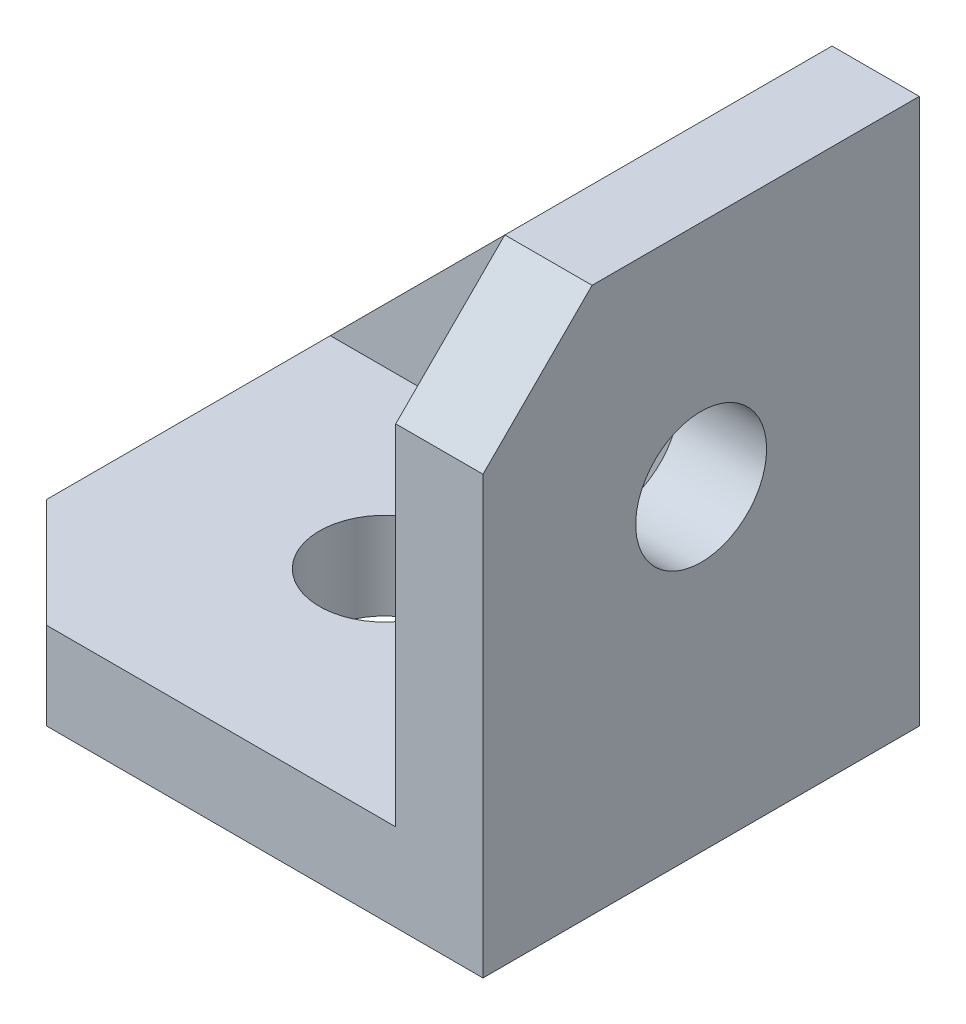
ISO-10303-21;
HEADER;
FILE_DESCRIPTION(('STEP AP214'),'2;1');
FILE_NAME('part.step','',(''),(''),'','','');
FILE_SCHEMA(('AUTOMOTIVE_DESIGN { 1 0 10303 214 1 1 1 1 }'));
ENDSEC;
DATA;
#1=APPLICATION_CONTEXT('core data for automotive mechanical design processes');
#2=APPLICATION_PROTOCOL_DEFINITION('international standard','automotive_design',2000,#1);
#3=PRODUCT_CONTEXT('',#1,'mechanical');
#4=PRODUCT('Part','Part','',(#3));
#5=PRODUCT_RELATED_PRODUCT_CATEGORY('part','',(#4));
#6=PRODUCT_DEFINITION_FORMATION('','',#4);
#7=PRODUCT_DEFINITION_CONTEXT('part definition',#1,'design');
#8=PRODUCT_DEFINITION('design','',#6,#7);
#9=PRODUCT_DEFINITION_SHAPE('','',#8);
#10=(LENGTH_UNIT() NAMED_UNIT(*) SI_UNIT(.MILLI.,.METRE.));
#11=(NAMED_UNIT(*) PLANE_ANGLE_UNIT() SI_UNIT($,.RADIAN.));
#12=(NAMED_UNIT(*) SI_UNIT($,.STERADIAN.) SOLID_ANGLE_UNIT());
#13=UNCERTAINTY_MEASURE_WITH_UNIT(LENGTH_MEASURE(1.E-05),#10,'distance_accuracy_value','');
#14=(GEOMETRIC_REPRESENTATION_CONTEXT(3) GLOBAL_UNCERTAINTY_ASSIGNED_CONTEXT((#13)) GLOBAL_UNIT_ASSIGNED_CONTEXT((#10,
#11,#12)) REPRESENTATION_CONTEXT('',''));
#15=CARTESIAN_POINT('',(0.,0.,0.));
#16=DIRECTION('',(0.,0.,1.));
#17=DIRECTION('',(1.,0.,0.));
#18=AXIS2_PLACEMENT_3D('',#15,#16,#17);
#19=CARTESIAN_POINT('',(-22.2500000000004,1010.,9.00023424550686));
#20=DIRECTION('',(0.,-1.,0.));
#21=DIRECTION('',(0.,0.,-1.));
#22=AXIS2_PLACEMENT_3D('',#19,#20,#21);
#23=PLANE('',#22);
#24=CARTESIAN_POINT('',(-32.75,1010.,-0.999765754493011));
#25=DIRECTION('',(0.,-1.,0.));
#26=DIRECTION('',(0.,0.,-1.));
#27=AXIS2_PLACEMENT_3D('',#24,#25,#26);
#28=CIRCLE('',#27,2.99999999999999);
#29=CARTESIAN_POINT('',(-32.75,1010.,-3.999765754493));
#30=VERTEX_POINT('',#29);
#31=EDGE_CURVE('E150',#30,#30,#28,.T.);
#32=ORIENTED_EDGE('',*,*,#31,.T.);
#33=EDGE_LOOP('',(#32));
#34=FACE_BOUND('',#33,.T.);
#35=DIRECTION('',(0.,0.,-1.));
#36=VECTOR('',#35,1.);
#37=CARTESIAN_POINT('',(-43.25,1010.,9.00023424550686));
#38=LINE('',#37,#36);
#39=CARTESIAN_POINT('',(-43.25,1010.,4.00023424550683));
#40=VERTEX_POINT('',#39);
#41=CARTESIAN_POINT('',(-43.25,1010.,-8.99976575449301));
#42=VERTEX_POINT('',#41);
#43=EDGE_CURVE('E157',#40,#42,#38,.T.);
#44=ORIENTED_EDGE('',*,*,#43,.F.);
#45=DIRECTION('',(0.707106781186543,0.,0.707106781186552));
#46=VECTOR('',#45,1.);
#47=CARTESIAN_POINT('',(-38.2499999999997,1010.,9.00023424550684));
#48=LINE('',#47,#46);
#49=CARTESIAN_POINT('',(-38.2499999999997,1010.,9.00023424550686));
#50=VERTEX_POINT('',#49);
#51=EDGE_CURVE('E43',#40,#50,#48,.T.);
#52=ORIENTED_EDGE('',*,*,#51,.T.);
#53=DIRECTION('',(-1.,0.,0.));
#54=VECTOR('',#53,1.);
#55=CARTESIAN_POINT('',(-22.2500000000004,1010.,9.00023424550686));
#56=LINE('',#55,#54);
#57=CARTESIAN_POINT('',(-22.2500000000004,1010.,9.00023424550686));
#58=VERTEX_POINT('',#57);
#59=EDGE_CURVE('E153',#58,#50,#56,.T.);
#60=ORIENTED_EDGE('',*,*,#59,.F.);
#61=DIRECTION('',(0.,0.,-1.));
#62=VECTOR('',#61,1.);
#63=CARTESIAN_POINT('',(-22.2500000000004,1010.,9.00023424550686));
#64=LINE('',#63,#62);
#65=CARTESIAN_POINT('',(-22.2500000000004,1010.,-8.99976575449314));
#66=VERTEX_POINT('',#65);
#67=EDGE_CURVE('E160',#58,#66,#64,.T.);
#68=ORIENTED_EDGE('',*,*,#67,.T.);
#69=DIRECTION('',(1.,0.,0.));
#70=VECTOR('',#69,1.);
#71=CARTESIAN_POINT('',(-22.2500000000006,1010.,-8.99976575449312));
#72=LINE('',#71,#70);
#73=EDGE_CURVE('E137',#42,#66,#72,.T.);
#74=ORIENTED_EDGE('',*,*,#73,.F.);
#75=EDGE_LOOP('',(#44,#52,#60,#68,#74));
#76=FACE_BOUND('',#75,.T.);
#77=ADVANCED_FACE('F35',(#34,#76),#23,.F.);
#78=CARTESIAN_POINT('',(-22.2500000000004,1031.,9.00023424550684));
#79=DIRECTION('',(1.,0.,0.));
#80=DIRECTION('',(0.,0.,-1.));
#81=AXIS2_PLACEMENT_3D('',#78,#79,#80);
#82=PLANE('',#81);
#83=CARTESIAN_POINT('',(-22.2500000000004,1020.5,-0.999765754493179));
#84=DIRECTION('',(1.,0.,0.));
#85=DIRECTION('',(0.,0.,-1.));
#86=AXIS2_PLACEMENT_3D('',#83,#84,#85);
#87=CIRCLE('',#86,2.99999999999989);
#88=CARTESIAN_POINT('',(-22.2500000000004,1020.5,-3.99976575449307));
#89=VERTEX_POINT('',#88);
#90=EDGE_CURVE('E146',#89,#89,#87,.T.);
#91=ORIENTED_EDGE('',*,*,#90,.T.);
#92=EDGE_LOOP('',(#91));
#93=FACE_BOUND('',#92,.T.);
#94=DIRECTION('',(0.,-1.,0.));
#95=VECTOR('',#94,1.);
#96=CARTESIAN_POINT('',(-22.2500000000004,1031.,9.00023424550684));
#97=LINE('',#96,#95);
#98=CARTESIAN_POINT('',(-22.2500000000004,1026.,9.00023424550684));
#99=VERTEX_POINT('',#98);
#100=EDGE_CURVE('E151',#99,#58,#97,.T.);
#101=ORIENTED_EDGE('',*,*,#100,.F.);
#102=DIRECTION('',(0.,-0.707106781186546,0.707106781186549));
#103=VECTOR('',#102,1.);
#104=CARTESIAN_POINT('',(-22.2500000000004,1031.,4.0002342455069));
#105=LINE('',#104,#103);
#106=CARTESIAN_POINT('',(-22.2500000000004,1031.,4.0002342455069));
#107=VERTEX_POINT('',#106);
#108=EDGE_CURVE('E192',#99,#107,#105,.F.);
#109=ORIENTED_EDGE('',*,*,#108,.T.);
#110=DIRECTION('',(0.,0.,-1.));
#111=VECTOR('',#110,1.);
#112=CARTESIAN_POINT('',(-22.2500000000004,1031.,9.00023424550684));
#113=LINE('',#112,#111);
#114=CARTESIAN_POINT('',(-22.2500000000004,1031.,-8.99976575449315));
#115=VERTEX_POINT('',#114);
#116=EDGE_CURVE('E163',#107,#115,#113,.T.);
#117=ORIENTED_EDGE('',*,*,#116,.T.);
#118=DIRECTION('',(0.,1.,0.));
#119=VECTOR('',#118,1.);
#120=CARTESIAN_POINT('',(-22.2500000000004,1031.,-8.99976575449315));
#121=LINE('',#120,#119);
#122=EDGE_CURVE('E174',#66,#115,#121,.T.);
#123=ORIENTED_EDGE('',*,*,#122,.F.);
#124=ORIENTED_EDGE('',*,*,#67,.F.);
#125=EDGE_LOOP('',(#101,#109,#117,#123,#124));
#126=FACE_BOUND('',#125,.T.);
#127=ADVANCED_FACE('F208',(#93,#126),#82,.F.);
#128=CARTESIAN_POINT('',(-43.2499999999996,1006.,9.00023424550684));
#129=DIRECTION('',(0.,-1.,0.));
#130=DIRECTION('',(0.,0.,-1.));
#131=AXIS2_PLACEMENT_3D('',#128,#129,#130);
#132=PLANE('',#131);
#133=DIRECTION('',(-1.,0.,0.));
#134=VECTOR('',#133,1.);
#135=CARTESIAN_POINT('',(-43.2499999999996,1006.,-10.9997657544931));
#136=LINE('',#135,#134);
#137=CARTESIAN_POINT('',(-18.25,1006.,-10.9997657544931));
#138=VERTEX_POINT('',#137);
#139=CARTESIAN_POINT('',(-43.2499999999996,1006.,-10.9997657544931));
#140=VERTEX_POINT('',#139);
#141=EDGE_CURVE('E131',#138,#140,#136,.T.);
#142=ORIENTED_EDGE('',*,*,#141,.F.);
#143=DIRECTION('',(0.,0.,-1.));
#144=VECTOR('',#143,1.);
#145=CARTESIAN_POINT('',(-18.25,1006.,9.00023424550684));
#146=LINE('',#145,#144);
#147=CARTESIAN_POINT('',(-18.25,1006.,9.00023424550684));
#148=VERTEX_POINT('',#147);
#149=EDGE_CURVE('E113',#148,#138,#146,.T.);
#150=ORIENTED_EDGE('',*,*,#149,.F.);
#151=DIRECTION('',(1.,0.,0.));
#152=VECTOR('',#151,1.);
#153=CARTESIAN_POINT('',(-43.2499999999996,1006.,9.00023424550684));
#154=LINE('',#153,#152);
#155=CARTESIAN_POINT('',(-38.2499999999997,1006.,9.00023424550684));
#156=VERTEX_POINT('',#155);
#157=EDGE_CURVE('E169',#156,#148,#154,.T.);
#158=ORIENTED_EDGE('',*,*,#157,.F.);
#159=DIRECTION('',(-0.707106781186543,0.,-0.707106781186552));
#160=VECTOR('',#159,1.);
#161=CARTESIAN_POINT('',(-40.7499999999996,1006.,6.50023424550687));
#162=LINE('',#161,#160);
#163=CARTESIAN_POINT('',(-43.2499999999996,1006.,4.00023424550684));
#164=VERTEX_POINT('',#163);
#165=EDGE_CURVE('E186',#156,#164,#162,.T.);
#166=ORIENTED_EDGE('',*,*,#165,.T.);
#167=DIRECTION('',(0.,0.,-1.));
#168=VECTOR('',#167,1.);
#169=CARTESIAN_POINT('',(-43.2499999999996,1006.,9.00023424550684));
#170=LINE('',#169,#168);
#171=EDGE_CURVE('E166',#164,#140,#170,.T.);
#172=ORIENTED_EDGE('',*,*,#171,.T.);
#173=EDGE_LOOP('',(#142,#150,#158,#166,#172));
#174=FACE_BOUND('',#173,.T.);
#175=CARTESIAN_POINT('',(-32.75,1006.,-0.999765754493011));
#176=DIRECTION('',(0.,-1.,0.));
#177=DIRECTION('',(0.,0.,-1.));
#178=AXIS2_PLACEMENT_3D('',#175,#176,#177);
#179=CIRCLE('',#178,2.99999999999999);
#180=CARTESIAN_POINT('',(-32.75,1006.,-3.999765754493));
#181=VERTEX_POINT('',#180);
#182=EDGE_CURVE('E147',#181,#181,#179,.T.);
#183=ORIENTED_EDGE('',*,*,#182,.F.);
#184=EDGE_LOOP('',(#183));
#185=FACE_BOUND('',#184,.T.);
#186=ADVANCED_FACE('F213',(#174,#185),#132,.T.);
#187=CARTESIAN_POINT('',(-43.2499999999996,1031.,9.00023424550681));
#188=DIRECTION('',(0.,0.,1.));
#189=DIRECTION('',(0.,-1.,0.));
#190=AXIS2_PLACEMENT_3D('',#187,#188,#189);
#191=PLANE('',#190);
#192=DIRECTION('',(0.,-1.,0.));
#193=VECTOR('',#192,1.);
#194=CARTESIAN_POINT('',(-18.25,1031.,9.00023424550681));
#195=LINE('',#194,#193);
#196=CARTESIAN_POINT('',(-18.25,1026.,9.00023424550682));
#197=VERTEX_POINT('',#196);
#198=EDGE_CURVE('E126',#197,#148,#195,.T.);
#199=ORIENTED_EDGE('',*,*,#198,.F.);
#200=DIRECTION('',(-1.,0.,0.));
#201=VECTOR('',#200,1.);
#202=CARTESIAN_POINT('',(-43.2499999999996,1026.,9.00023424550682));
#203=LINE('',#202,#201);
#204=EDGE_CURVE('E56',#197,#99,#203,.T.);
#205=ORIENTED_EDGE('',*,*,#204,.T.);
#206=ORIENTED_EDGE('',*,*,#100,.T.);
#207=ORIENTED_EDGE('',*,*,#59,.T.);
#208=DIRECTION('',(0.,-1.,0.));
#209=VECTOR('',#208,1.);
#210=CARTESIAN_POINT('',(-38.2499999999997,1006.,9.00023424550684));
#211=LINE('',#210,#209);
#212=EDGE_CURVE('E189',#50,#156,#211,.T.);
#213=ORIENTED_EDGE('',*,*,#212,.T.);
#214=ORIENTED_EDGE('',*,*,#157,.T.);
#215=EDGE_LOOP('',(#199,#205,#206,#207,#213,#214));
#216=FACE_BOUND('',#215,.T.);
#217=ADVANCED_FACE('F204',(#216),#191,.T.);
#218=CARTESIAN_POINT('',(-43.2499999999996,1031.,-30.9997657544932));
#219=DIRECTION('',(0.,1.,0.));
#220=DIRECTION('',(0.,0.,1.));
#221=AXIS2_PLACEMENT_3D('',#218,#219,#220);
#222=PLANE('',#221);
#223=DIRECTION('',(1.,0.,0.));
#224=VECTOR('',#223,1.);
#225=CARTESIAN_POINT('',(-48.25,1031.,-10.9997657544931));
#226=LINE('',#225,#224);
#227=CARTESIAN_POINT('',(-22.2500000000002,1031.,-10.999765754493));
#228=VERTEX_POINT('',#227);
#229=CARTESIAN_POINT('',(-18.25,1031.,-10.9997657544931));
#230=VERTEX_POINT('',#229);
#231=EDGE_CURVE('E118',#228,#230,#226,.T.);
#232=ORIENTED_EDGE('',*,*,#231,.F.);
#233=EDGE_CURVE('E156',#115,#228,#113,.T.);
#234=ORIENTED_EDGE('',*,*,#233,.F.);
#235=ORIENTED_EDGE('',*,*,#116,.F.);
#236=DIRECTION('',(1.,0.,0.));
#237=VECTOR('',#236,1.);
#238=CARTESIAN_POINT('',(-43.2499999999996,1031.,4.0002342455069));
#239=LINE('',#238,#237);
#240=CARTESIAN_POINT('',(-18.25,1031.,4.0002342455069));
#241=VERTEX_POINT('',#240);
#242=EDGE_CURVE('E125',#107,#241,#239,.T.);
#243=ORIENTED_EDGE('',*,*,#242,.T.);
#244=DIRECTION('',(0.,0.,1.));
#245=VECTOR('',#244,1.);
#246=CARTESIAN_POINT('',(-18.25,1031.,-30.9997657544932));
#247=LINE('',#246,#245);
#248=EDGE_CURVE('E110',#230,#241,#247,.T.);
#249=ORIENTED_EDGE('',*,*,#248,.F.);
#250=EDGE_LOOP('',(#232,#234,#235,#243,#249));
#251=FACE_BOUND('',#250,.T.);
#252=ADVANCED_FACE('F122',(#251),#222,.T.);
#253=CARTESIAN_POINT('',(-43.2499999999996,0.,0.));
#254=DIRECTION('',(1.,0.,0.));
#255=DIRECTION('',(0.,0.,-1.));
#256=AXIS2_PLACEMENT_3D('',#253,#254,#255);
#257=PLANE('',#256);
#258=DIRECTION('',(0.,0.,-1.));
#259=VECTOR('',#258,1.);
#260=CARTESIAN_POINT('',(-43.25,1010.,9.00023424550708));
#261=LINE('',#260,#259);
#262=CARTESIAN_POINT('',(-43.2500000000002,1010.,-10.9997657544929));
#263=VERTEX_POINT('',#262);
#264=EDGE_CURVE('E140',#42,#263,#261,.T.);
#265=ORIENTED_EDGE('',*,*,#264,.T.);
#266=DIRECTION('',(0.,-1.,0.));
#267=VECTOR('',#266,1.);
#268=CARTESIAN_POINT('',(-43.2499999999996,0.,-10.9997657544931));
#269=LINE('',#268,#267);
#270=EDGE_CURVE('E129',#263,#140,#269,.T.);
#271=ORIENTED_EDGE('',*,*,#270,.T.);
#272=ORIENTED_EDGE('',*,*,#171,.F.);
#273=DIRECTION('',(0.,1.,0.));
#274=VECTOR('',#273,1.);
#275=CARTESIAN_POINT('',(-43.2499999999996,1010.,4.00023424550683));
#276=LINE('',#275,#274);
#277=EDGE_CURVE('E184',#164,#40,#276,.T.);
#278=ORIENTED_EDGE('',*,*,#277,.T.);
#279=ORIENTED_EDGE('',*,*,#43,.T.);
#280=EDGE_LOOP('',(#265,#271,#272,#278,#279));
#281=FACE_BOUND('',#280,.T.);
#282=ADVANCED_FACE('F211',(#281),#257,.F.);
#283=CARTESIAN_POINT('',(-18.25,0.,0.));
#284=DIRECTION('',(1.,0.,0.));
#285=DIRECTION('',(0.,0.,-1.));
#286=AXIS2_PLACEMENT_3D('',#283,#284,#285);
#287=PLANE('',#286);
#288=DIRECTION('',(0.,-1.,0.));
#289=VECTOR('',#288,1.);
#290=CARTESIAN_POINT('',(-18.25,1031.,-10.9997657544931));
#291=LINE('',#290,#289);
#292=EDGE_CURVE('E106',#230,#138,#291,.T.);
#293=ORIENTED_EDGE('',*,*,#292,.F.);
#294=ORIENTED_EDGE('',*,*,#248,.T.);
#295=DIRECTION('',(0.,0.707106781186546,-0.707106781186549));
#296=VECTOR('',#295,1.);
#297=CARTESIAN_POINT('',(-18.25,517.500117122756,517.500117122754));
#298=LINE('',#297,#296);
#299=EDGE_CURVE('E181',#241,#197,#298,.F.);
#300=ORIENTED_EDGE('',*,*,#299,.T.);
#301=ORIENTED_EDGE('',*,*,#198,.T.);
#302=ORIENTED_EDGE('',*,*,#149,.T.);
#303=EDGE_LOOP('',(#293,#294,#300,#301,#302));
#304=FACE_BOUND('',#303,.T.);
#305=CARTESIAN_POINT('',(-18.25,1020.5,-0.999765754493179));
#306=DIRECTION('',(1.,0.,0.));
#307=DIRECTION('',(0.,0.,-1.));
#308=AXIS2_PLACEMENT_3D('',#305,#306,#307);
#309=CIRCLE('',#308,2.99999999999989);
#310=CARTESIAN_POINT('',(-18.25,1020.5,-3.99976575449307));
#311=VERTEX_POINT('',#310);
#312=EDGE_CURVE('E143',#311,#311,#309,.T.);
#313=ORIENTED_EDGE('',*,*,#312,.F.);
#314=EDGE_LOOP('',(#313));
#315=FACE_BOUND('',#314,.T.);
#316=ADVANCED_FACE('F108',(#304,#315),#287,.T.);
#317=CARTESIAN_POINT('',(-32.75,1006.,-0.999765754493011));
#318=DIRECTION('',(0.,-1.,0.));
#319=DIRECTION('',(0.,0.,-1.));
#320=AXIS2_PLACEMENT_3D('',#317,#318,#319);
#321=CYLINDRICAL_SURFACE('',#320,2.99999999999999);
#322=ORIENTED_EDGE('',*,*,#182,.T.);
#323=EDGE_LOOP('',(#322));
#324=FACE_BOUND('',#323,.T.);
#325=ORIENTED_EDGE('',*,*,#31,.F.);
#326=EDGE_LOOP('',(#325));
#327=FACE_BOUND('',#326,.T.);
#328=ADVANCED_FACE('F227',(#324,#327),#321,.F.);
#329=CARTESIAN_POINT('',(-18.25,1020.5,-0.999765754493179));
#330=DIRECTION('',(1.,0.,0.));
#331=DIRECTION('',(0.,0.,-1.));
#332=AXIS2_PLACEMENT_3D('',#329,#330,#331);
#333=CYLINDRICAL_SURFACE('',#332,2.99999999999989);
#334=ORIENTED_EDGE('',*,*,#312,.T.);
#335=EDGE_LOOP('',(#334));
#336=FACE_BOUND('',#335,.T.);
#337=ORIENTED_EDGE('',*,*,#90,.F.);
#338=EDGE_LOOP('',(#337));
#339=FACE_BOUND('',#338,.T.);
#340=ADVANCED_FACE('F220',(#336,#339),#333,.F.);
#341=CARTESIAN_POINT('',(-43.2500000000002,1010.,-10.9997657544929));
#342=DIRECTION('',(-0.707106781186546,0.707106781186549,0.));
#343=DIRECTION('',(0.707106781186549,0.707106781186546,0.));
#344=AXIS2_PLACEMENT_3D('',#341,#342,#343);
#345=PLANE('',#344);
#346=DIRECTION('',(0.707106781186549,0.707106781186546,0.));
#347=VECTOR('',#346,1.);
#348=CARTESIAN_POINT('',(-43.2500000000002,1010.,-10.9997657544929));
#349=LINE('',#348,#347);
#350=EDGE_CURVE('E11',#263,#228,#349,.T.);
#351=ORIENTED_EDGE('',*,*,#350,.F.);
#352=ORIENTED_EDGE('',*,*,#264,.F.);
#353=DIRECTION('',(0.707106781186549,0.707106781186546,0.));
#354=VECTOR('',#353,1.);
#355=CARTESIAN_POINT('',(-43.2500000000001,1010.,-8.9997657544929));
#356=LINE('',#355,#354);
#357=EDGE_CURVE('E135',#42,#115,#356,.T.);
#358=ORIENTED_EDGE('',*,*,#357,.T.);
#359=ORIENTED_EDGE('',*,*,#233,.T.);
#360=EDGE_LOOP('',(#351,#352,#358,#359));
#361=FACE_BOUND('',#360,.T.);
#362=ADVANCED_FACE('F218',(#361),#345,.T.);
#363=CARTESIAN_POINT('',(-30.75,1018.5,-8.99976575449304));
#364=DIRECTION('',(0.,0.,-1.));
#365=DIRECTION('',(-1.,0.,0.));
#366=AXIS2_PLACEMENT_3D('',#363,#364,#365);
#367=PLANE('',#366);
#368=ORIENTED_EDGE('',*,*,#357,.F.);
#369=ORIENTED_EDGE('',*,*,#73,.T.);
#370=ORIENTED_EDGE('',*,*,#122,.T.);
#371=EDGE_LOOP('',(#368,#369,#370));
#372=FACE_BOUND('',#371,.T.);
#373=ADVANCED_FACE('F217',(#372),#367,.F.);
#374=CARTESIAN_POINT('',(-43.2499999999996,1031.,4.0002342455069));
#375=DIRECTION('',(0.,-0.707106781186549,-0.707106781186546));
#376=DIRECTION('',(1.,0.,0.));
#377=AXIS2_PLACEMENT_3D('',#374,#375,#376);
#378=PLANE('',#377);
#379=ORIENTED_EDGE('',*,*,#108,.F.);
#380=ORIENTED_EDGE('',*,*,#204,.F.);
#381=ORIENTED_EDGE('',*,*,#299,.F.);
#382=ORIENTED_EDGE('',*,*,#242,.F.);
#383=EDGE_LOOP('',(#379,#380,#381,#382));
#384=FACE_BOUND('',#383,.T.);
#385=ADVANCED_FACE('F216',(#384),#378,.F.);
#386=CARTESIAN_POINT('',(-38.2499999999997,1031.,9.00023424550681));
#387=DIRECTION('',(-0.707106781186552,0.,0.707106781186543));
#388=DIRECTION('',(0.,1.,0.));
#389=AXIS2_PLACEMENT_3D('',#386,#387,#388);
#390=PLANE('',#389);
#391=ORIENTED_EDGE('',*,*,#51,.F.);
#392=ORIENTED_EDGE('',*,*,#277,.F.);
#393=ORIENTED_EDGE('',*,*,#165,.F.);
#394=ORIENTED_EDGE('',*,*,#212,.F.);
#395=EDGE_LOOP('',(#391,#392,#393,#394));
#396=FACE_BOUND('',#395,.T.);
#397=ADVANCED_FACE('F37',(#396),#390,.T.);
#398=CARTESIAN_POINT('',(-48.25,1031.,-10.9997657544931));
#399=DIRECTION('',(0.,0.,1.));
#400=DIRECTION('',(1.,0.,0.));
#401=AXIS2_PLACEMENT_3D('',#398,#399,#400);
#402=PLANE('',#401);
#403=ORIENTED_EDGE('',*,*,#141,.T.);
#404=ORIENTED_EDGE('',*,*,#270,.F.);
#405=ORIENTED_EDGE('',*,*,#350,.T.);
#406=ORIENTED_EDGE('',*,*,#231,.T.);
#407=ORIENTED_EDGE('',*,*,#292,.T.);
#408=EDGE_LOOP('',(#403,#404,#405,#406,#407));
#409=FACE_BOUND('',#408,.T.);
#410=ADVANCED_FACE('F128',(#409),#402,.F.);
#411=CLOSED_SHELL('',(#77,#127,#186,#217,#252,#282,#316,#328,#340,#362,#373,#385,#397,#410));
#412=MANIFOLD_SOLID_BREP('B2',#411);
#413=ADVANCED_BREP_SHAPE_REPRESENTATION('',(#18,#412),#14);
#414=SHAPE_DEFINITION_REPRESENTATION(#9,#413);
ENDSEC;
END-ISO-10303-21;
